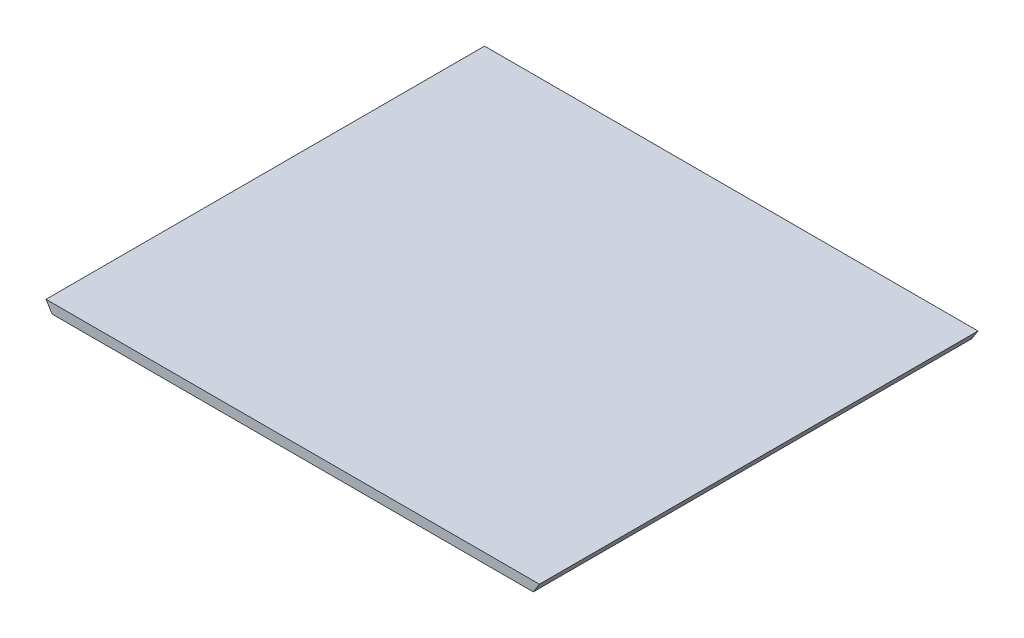
ISO-10303-21;
HEADER;
FILE_DESCRIPTION(('STEP AP214'),'2;1');
FILE_NAME('part.step','',(''),(''),'','','');
FILE_SCHEMA(('AUTOMOTIVE_DESIGN { 1 0 10303 214 1 1 1 1 }'));
ENDSEC;
DATA;
#1=APPLICATION_CONTEXT('core data for automotive mechanical design processes');
#2=APPLICATION_PROTOCOL_DEFINITION('international standard','automotive_design',2000,#1);
#3=PRODUCT_CONTEXT('',#1,'mechanical');
#4=PRODUCT('Part','Part','',(#3));
#5=PRODUCT_RELATED_PRODUCT_CATEGORY('part','',(#4));
#6=PRODUCT_DEFINITION_FORMATION('','',#4);
#7=PRODUCT_DEFINITION_CONTEXT('part definition',#1,'design');
#8=PRODUCT_DEFINITION('design','',#6,#7);
#9=PRODUCT_DEFINITION_SHAPE('','',#8);
#10=(LENGTH_UNIT() NAMED_UNIT(*) SI_UNIT(.MILLI.,.METRE.));
#11=(NAMED_UNIT(*) PLANE_ANGLE_UNIT() SI_UNIT($,.RADIAN.));
#12=(NAMED_UNIT(*) SI_UNIT($,.STERADIAN.) SOLID_ANGLE_UNIT());
#13=UNCERTAINTY_MEASURE_WITH_UNIT(LENGTH_MEASURE(1.E-05),#10,'distance_accuracy_value','');
#14=(GEOMETRIC_REPRESENTATION_CONTEXT(3) GLOBAL_UNCERTAINTY_ASSIGNED_CONTEXT((#13)) GLOBAL_UNIT_ASSIGNED_CONTEXT((#10,
#11,#12)) REPRESENTATION_CONTEXT('',''));
#15=CARTESIAN_POINT('',(0.,0.,0.));
#16=DIRECTION('',(0.,0.,1.));
#17=DIRECTION('',(1.,0.,0.));
#18=AXIS2_PLACEMENT_3D('',#15,#16,#17);
#19=CARTESIAN_POINT('',(-246.858259493534,254.023673560284,450.));
#20=DIRECTION('',(0.,1.,0.));
#21=DIRECTION('',(-1.,0.,0.));
#22=AXIS2_PLACEMENT_3D('',#19,#20,#21);
#23=PLANE('',#22);
#24=DIRECTION('',(1.,0.,0.));
#25=VECTOR('',#24,1.);
#26=CARTESIAN_POINT('',(-246.858259493534,254.023673560284,0.));
#27=LINE('',#26,#25);
#28=CARTESIAN_POINT('',(-246.858259493534,254.023673560284,0.));
#29=VERTEX_POINT('',#28);
#30=CARTESIAN_POINT('',(246.858259493534,254.023673560284,0.));
#31=VERTEX_POINT('',#30);
#32=EDGE_CURVE('E96',#29,#31,#27,.T.);
#33=ORIENTED_EDGE('',*,*,#32,.T.);
#34=DIRECTION('',(0.,0.,-1.));
#35=VECTOR('',#34,1.);
#36=CARTESIAN_POINT('',(246.858259493534,254.023673560284,450.));
#37=LINE('',#36,#35);
#38=CARTESIAN_POINT('',(246.858259493534,254.023673560284,450.));
#39=VERTEX_POINT('',#38);
#40=EDGE_CURVE('E11',#39,#31,#37,.T.);
#41=ORIENTED_EDGE('',*,*,#40,.F.);
#42=DIRECTION('',(1.,0.,0.));
#43=VECTOR('',#42,1.);
#44=CARTESIAN_POINT('',(-246.858259493534,254.023673560284,450.));
#45=LINE('',#44,#43);
#46=CARTESIAN_POINT('',(-246.858259493534,254.023673560284,450.));
#47=VERTEX_POINT('',#46);
#48=EDGE_CURVE('E84',#47,#39,#45,.T.);
#49=ORIENTED_EDGE('',*,*,#48,.F.);
#50=DIRECTION('',(0.,0.,-1.));
#51=VECTOR('',#50,1.);
#52=CARTESIAN_POINT('',(-246.858259493534,254.023673560284,450.));
#53=LINE('',#52,#51);
#54=EDGE_CURVE('E92',#47,#29,#53,.T.);
#55=ORIENTED_EDGE('',*,*,#54,.T.);
#56=EDGE_LOOP('',(#33,#41,#49,#55));
#57=FACE_BOUND('',#56,.T.);
#58=ADVANCED_FACE('F33',(#57),#23,.F.);
#59=CARTESIAN_POINT('',(253.156995608474,264.023673560284,450.));
#60=DIRECTION('',(-0.8461397454245,0.532961097279119,0.));
#61=DIRECTION('',(-0.532961097279119,-0.8461397454245,0.));
#62=AXIS2_PLACEMENT_3D('',#59,#60,#61);
#63=PLANE('',#62);
#64=DIRECTION('',(0.532961097279119,0.8461397454245,0.));
#65=VECTOR('',#64,1.);
#66=CARTESIAN_POINT('',(253.156995608474,264.023673560284,0.));
#67=LINE('',#66,#65);
#68=CARTESIAN_POINT('',(253.156995608474,264.023673560284,0.));
#69=VERTEX_POINT('',#68);
#70=EDGE_CURVE('E88',#31,#69,#67,.T.);
#71=ORIENTED_EDGE('',*,*,#70,.T.);
#72=DIRECTION('',(0.,0.,-1.));
#73=VECTOR('',#72,1.);
#74=CARTESIAN_POINT('',(253.156995608474,264.023673560284,450.));
#75=LINE('',#74,#73);
#76=CARTESIAN_POINT('',(253.156995608474,264.023673560284,450.));
#77=VERTEX_POINT('',#76);
#78=EDGE_CURVE('E41',#77,#69,#75,.T.);
#79=ORIENTED_EDGE('',*,*,#78,.F.);
#80=DIRECTION('',(0.532961097279119,0.8461397454245,0.));
#81=VECTOR('',#80,1.);
#82=CARTESIAN_POINT('',(253.156995608474,264.023673560284,450.));
#83=LINE('',#82,#81);
#84=EDGE_CURVE('E79',#39,#77,#83,.T.);
#85=ORIENTED_EDGE('',*,*,#84,.F.);
#86=ORIENTED_EDGE('',*,*,#40,.T.);
#87=EDGE_LOOP('',(#71,#79,#85,#86));
#88=FACE_BOUND('',#87,.T.);
#89=ADVANCED_FACE('F87',(#88),#63,.F.);
#90=CARTESIAN_POINT('',(253.156995608474,264.023673560284,450.));
#91=DIRECTION('',(0.,-1.,0.));
#92=DIRECTION('',(1.,0.,0.));
#93=AXIS2_PLACEMENT_3D('',#90,#91,#92);
#94=PLANE('',#93);
#95=DIRECTION('',(-1.,0.,0.));
#96=VECTOR('',#95,1.);
#97=CARTESIAN_POINT('',(253.156995608474,264.023673560284,0.));
#98=LINE('',#97,#96);
#99=CARTESIAN_POINT('',(-253.156995608474,264.023673560284,0.));
#100=VERTEX_POINT('',#99);
#101=EDGE_CURVE('E66',#69,#100,#98,.T.);
#102=ORIENTED_EDGE('',*,*,#101,.T.);
#103=DIRECTION('',(0.,0.,-1.));
#104=VECTOR('',#103,1.);
#105=CARTESIAN_POINT('',(-253.156995608474,264.023673560284,450.));
#106=LINE('',#105,#104);
#107=CARTESIAN_POINT('',(-253.156995608474,264.023673560284,450.));
#108=VERTEX_POINT('',#107);
#109=EDGE_CURVE('E89',#108,#100,#106,.T.);
#110=ORIENTED_EDGE('',*,*,#109,.F.);
#111=DIRECTION('',(-1.,0.,0.));
#112=VECTOR('',#111,1.);
#113=CARTESIAN_POINT('',(253.156995608474,264.023673560284,450.));
#114=LINE('',#113,#112);
#115=EDGE_CURVE('E82',#77,#108,#114,.T.);
#116=ORIENTED_EDGE('',*,*,#115,.F.);
#117=ORIENTED_EDGE('',*,*,#78,.T.);
#118=EDGE_LOOP('',(#102,#110,#116,#117));
#119=FACE_BOUND('',#118,.T.);
#120=ADVANCED_FACE('F90',(#119),#94,.F.);
#121=CARTESIAN_POINT('',(-253.156995608474,264.023673560284,450.));
#122=DIRECTION('',(0.8461397454245,0.532961097279119,0.));
#123=DIRECTION('',(-0.532961097279119,0.8461397454245,0.));
#124=AXIS2_PLACEMENT_3D('',#121,#122,#123);
#125=PLANE('',#124);
#126=DIRECTION('',(0.532961097279119,-0.8461397454245,0.));
#127=VECTOR('',#126,1.);
#128=CARTESIAN_POINT('',(-253.156995608474,264.023673560284,0.));
#129=LINE('',#128,#127);
#130=EDGE_CURVE('E72',#100,#29,#129,.T.);
#131=ORIENTED_EDGE('',*,*,#130,.T.);
#132=ORIENTED_EDGE('',*,*,#54,.F.);
#133=DIRECTION('',(0.532961097279119,-0.8461397454245,0.));
#134=VECTOR('',#133,1.);
#135=CARTESIAN_POINT('',(-253.156995608474,264.023673560284,450.));
#136=LINE('',#135,#134);
#137=EDGE_CURVE('E49',#108,#47,#136,.T.);
#138=ORIENTED_EDGE('',*,*,#137,.F.);
#139=ORIENTED_EDGE('',*,*,#109,.T.);
#140=EDGE_LOOP('',(#131,#132,#138,#139));
#141=FACE_BOUND('',#140,.T.);
#142=ADVANCED_FACE('F103',(#141),#125,.F.);
#143=CARTESIAN_POINT('',(0.,0.,450.));
#144=DIRECTION('',(0.,0.,-1.));
#145=DIRECTION('',(-1.,0.,0.));
#146=AXIS2_PLACEMENT_3D('',#143,#144,#145);
#147=PLANE('',#146);
#148=ORIENTED_EDGE('',*,*,#48,.T.);
#149=ORIENTED_EDGE('',*,*,#84,.T.);
#150=ORIENTED_EDGE('',*,*,#115,.T.);
#151=ORIENTED_EDGE('',*,*,#137,.T.);
#152=EDGE_LOOP('',(#148,#149,#150,#151));
#153=FACE_BOUND('',#152,.T.);
#154=ADVANCED_FACE('F80',(#153),#147,.F.);
#155=CARTESIAN_POINT('',(0.,0.,0.));
#156=DIRECTION('',(0.,0.,-1.));
#157=DIRECTION('',(-1.,0.,0.));
#158=AXIS2_PLACEMENT_3D('',#155,#156,#157);
#159=PLANE('',#158);
#160=ORIENTED_EDGE('',*,*,#32,.F.);
#161=ORIENTED_EDGE('',*,*,#130,.F.);
#162=ORIENTED_EDGE('',*,*,#101,.F.);
#163=ORIENTED_EDGE('',*,*,#70,.F.);
#164=EDGE_LOOP('',(#160,#161,#162,#163));
#165=FACE_BOUND('',#164,.T.);
#166=ADVANCED_FACE('F106',(#165),#159,.T.);
#167=CLOSED_SHELL('',(#58,#89,#120,#142,#154,#166));
#168=MANIFOLD_SOLID_BREP('B2',#167);
#169=ADVANCED_BREP_SHAPE_REPRESENTATION('',(#18,#168),#14);
#170=SHAPE_DEFINITION_REPRESENTATION(#9,#169);
ENDSEC;
END-ISO-10303-21;
